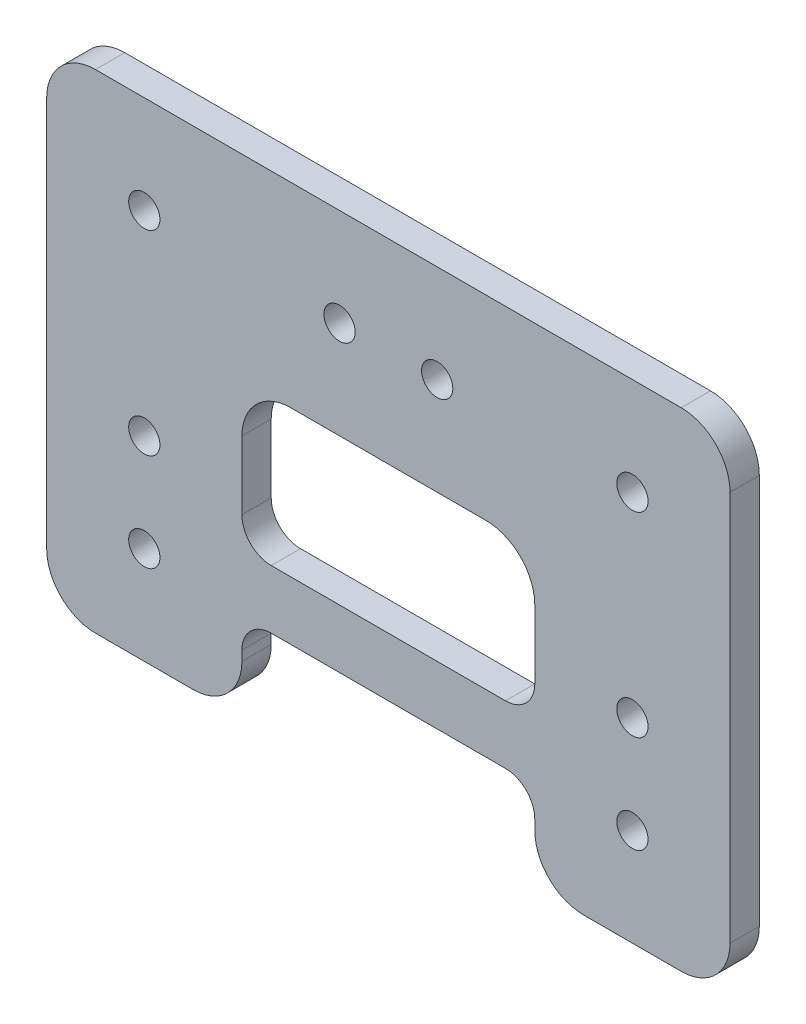
ISO-10303-21;
HEADER;
FILE_DESCRIPTION(('STEP AP214'),'2;1');
FILE_NAME('part.step','',(''),(''),'','','');
FILE_SCHEMA(('AUTOMOTIVE_DESIGN { 1 0 10303 214 1 1 1 1 }'));
ENDSEC;
DATA;
#1=APPLICATION_CONTEXT('core data for automotive mechanical design processes');
#2=APPLICATION_PROTOCOL_DEFINITION('international standard','automotive_design',2000,#1);
#3=PRODUCT_CONTEXT('',#1,'mechanical');
#4=PRODUCT('Part','Part','',(#3));
#5=PRODUCT_RELATED_PRODUCT_CATEGORY('part','',(#4));
#6=PRODUCT_DEFINITION_FORMATION('','',#4);
#7=PRODUCT_DEFINITION_CONTEXT('part definition',#1,'design');
#8=PRODUCT_DEFINITION('design','',#6,#7);
#9=PRODUCT_DEFINITION_SHAPE('','',#8);
#10=(LENGTH_UNIT() NAMED_UNIT(*) SI_UNIT(.MILLI.,.METRE.));
#11=(NAMED_UNIT(*) PLANE_ANGLE_UNIT() SI_UNIT($,.RADIAN.));
#12=(NAMED_UNIT(*) SI_UNIT($,.STERADIAN.) SOLID_ANGLE_UNIT());
#13=UNCERTAINTY_MEASURE_WITH_UNIT(LENGTH_MEASURE(1.E-05),#10,'distance_accuracy_value','');
#14=(GEOMETRIC_REPRESENTATION_CONTEXT(3) GLOBAL_UNCERTAINTY_ASSIGNED_CONTEXT((#13)) GLOBAL_UNIT_ASSIGNED_CONTEXT((#10,
#11,#12)) REPRESENTATION_CONTEXT('',''));
#15=CARTESIAN_POINT('',(0.,0.,0.));
#16=DIRECTION('',(0.,0.,1.));
#17=DIRECTION('',(1.,0.,0.));
#18=AXIS2_PLACEMENT_3D('',#15,#16,#17);
#19=CARTESIAN_POINT('',(-15.,-25.,0.));
#20=DIRECTION('',(-1.,0.,0.));
#21=DIRECTION('',(0.,-1.,0.));
#22=AXIS2_PLACEMENT_3D('',#19,#20,#21);
#23=PLANE('',#22);
#24=DIRECTION('',(0.,-1.,0.));
#25=VECTOR('',#24,1.);
#26=CARTESIAN_POINT('',(-15.,-25.,3.));
#27=LINE('',#26,#25);
#28=CARTESIAN_POINT('',(-15.,0.,3.));
#29=VERTEX_POINT('',#28);
#30=CARTESIAN_POINT('',(-15.,-7.00000000000001,3.));
#31=VERTEX_POINT('',#30);
#32=EDGE_CURVE('E377',#29,#31,#27,.T.);
#33=ORIENTED_EDGE('',*,*,#32,.T.);
#34=DIRECTION('',(0.,0.,1.));
#35=VECTOR('',#34,1.);
#36=CARTESIAN_POINT('',(-15.,-7.00000000000001,0.));
#37=LINE('',#36,#35);
#38=CARTESIAN_POINT('',(-15.,-7.00000000000001,0.));
#39=VERTEX_POINT('',#38);
#40=EDGE_CURVE('E49',#31,#39,#37,.F.);
#41=ORIENTED_EDGE('',*,*,#40,.T.);
#42=DIRECTION('',(0.,-1.,0.));
#43=VECTOR('',#42,1.);
#44=CARTESIAN_POINT('',(-15.,-25.,0.));
#45=LINE('',#44,#43);
#46=CARTESIAN_POINT('',(-15.,0.,0.));
#47=VERTEX_POINT('',#46);
#48=EDGE_CURVE('E343',#47,#39,#45,.T.);
#49=ORIENTED_EDGE('',*,*,#48,.F.);
#50=DIRECTION('',(0.,0.,1.));
#51=VECTOR('',#50,1.);
#52=CARTESIAN_POINT('',(-15.,0.,3.));
#53=LINE('',#52,#51);
#54=EDGE_CURVE('E280',#47,#29,#53,.T.);
#55=ORIENTED_EDGE('',*,*,#54,.T.);
#56=EDGE_LOOP('',(#33,#41,#49,#55));
#57=FACE_BOUND('',#56,.T.);
#58=ADVANCED_FACE('F34',(#57),#23,.F.);
#59=CARTESIAN_POINT('',(15.,5.,0.));
#60=DIRECTION('',(1.,0.,0.));
#61=DIRECTION('',(0.,1.,0.));
#62=AXIS2_PLACEMENT_3D('',#59,#60,#61);
#63=PLANE('',#62);
#64=DIRECTION('',(0.,1.,0.));
#65=VECTOR('',#64,1.);
#66=CARTESIAN_POINT('',(15.,5.,0.));
#67=LINE('',#66,#65);
#68=CARTESIAN_POINT('',(15.,-7.,0.));
#69=VERTEX_POINT('',#68);
#70=CARTESIAN_POINT('',(15.,0.,0.));
#71=VERTEX_POINT('',#70);
#72=EDGE_CURVE('E366',#69,#71,#67,.T.);
#73=ORIENTED_EDGE('',*,*,#72,.F.);
#74=DIRECTION('',(0.,0.,1.));
#75=VECTOR('',#74,1.);
#76=CARTESIAN_POINT('',(15.,-7.,0.));
#77=LINE('',#76,#75);
#78=CARTESIAN_POINT('',(15.,-7.,3.));
#79=VERTEX_POINT('',#78);
#80=EDGE_CURVE('E300',#69,#79,#77,.T.);
#81=ORIENTED_EDGE('',*,*,#80,.T.);
#82=DIRECTION('',(0.,1.,0.));
#83=VECTOR('',#82,1.);
#84=CARTESIAN_POINT('',(15.,5.,3.));
#85=LINE('',#84,#83);
#86=CARTESIAN_POINT('',(15.,0.,3.));
#87=VERTEX_POINT('',#86);
#88=EDGE_CURVE('E374',#79,#87,#85,.T.);
#89=ORIENTED_EDGE('',*,*,#88,.T.);
#90=DIRECTION('',(0.,0.,1.));
#91=VECTOR('',#90,1.);
#92=CARTESIAN_POINT('',(15.,0.,0.));
#93=LINE('',#92,#91);
#94=EDGE_CURVE('E268',#87,#71,#93,.F.);
#95=ORIENTED_EDGE('',*,*,#94,.T.);
#96=EDGE_LOOP('',(#73,#81,#89,#95));
#97=FACE_BOUND('',#96,.T.);
#98=ADVANCED_FACE('F459',(#97),#63,.F.);
#99=CARTESIAN_POINT('',(-35.,-25.,3.));
#100=DIRECTION('',(0.,1.,0.));
#101=DIRECTION('',(0.,0.,1.));
#102=AXIS2_PLACEMENT_3D('',#99,#100,#101);
#103=PLANE('',#102);
#104=DIRECTION('',(1.,0.,0.));
#105=VECTOR('',#104,1.);
#106=CARTESIAN_POINT('',(-35.,-25.,3.));
#107=LINE('',#106,#105);
#108=CARTESIAN_POINT('',(-30.,-25.,3.));
#109=VERTEX_POINT('',#108);
#110=CARTESIAN_POINT('',(-20.,-25.,3.));
#111=VERTEX_POINT('',#110);
#112=EDGE_CURVE('E234',#109,#111,#107,.T.);
#113=ORIENTED_EDGE('',*,*,#112,.F.);
#114=DIRECTION('',(0.,0.,-1.));
#115=VECTOR('',#114,1.);
#116=CARTESIAN_POINT('',(-30.,-25.,3.));
#117=LINE('',#116,#115);
#118=CARTESIAN_POINT('',(-30.,-25.,0.));
#119=VERTEX_POINT('',#118);
#120=EDGE_CURVE('E277',#109,#119,#117,.T.);
#121=ORIENTED_EDGE('',*,*,#120,.T.);
#122=DIRECTION('',(1.,0.,0.));
#123=VECTOR('',#122,1.);
#124=CARTESIAN_POINT('',(-35.,-25.,0.));
#125=LINE('',#124,#123);
#126=CARTESIAN_POINT('',(-20.,-25.,0.));
#127=VERTEX_POINT('',#126);
#128=EDGE_CURVE('E228',#119,#127,#125,.T.);
#129=ORIENTED_EDGE('',*,*,#128,.T.);
#130=DIRECTION('',(0.,0.,1.));
#131=VECTOR('',#130,1.);
#132=CARTESIAN_POINT('',(-20.,-25.,3.));
#133=LINE('',#132,#131);
#134=EDGE_CURVE('E274',#127,#111,#133,.T.);
#135=ORIENTED_EDGE('',*,*,#134,.T.);
#136=EDGE_LOOP('',(#113,#121,#129,#135));
#137=FACE_BOUND('',#136,.T.);
#138=ADVANCED_FACE('F464',(#137),#103,.F.);
#139=CARTESIAN_POINT('',(0.,0.,3.));
#140=DIRECTION('',(0.,0.,1.));
#141=DIRECTION('',(1.,0.,0.));
#142=AXIS2_PLACEMENT_3D('',#139,#140,#141);
#143=PLANE('',#142);
#144=CARTESIAN_POINT('',(-15.,-19.,3.));
#145=VERTEX_POINT('',#144);
#146=CARTESIAN_POINT('',(-15.,-20.,3.));
#147=VERTEX_POINT('',#146);
#148=EDGE_CURVE('E352',#145,#147,#27,.T.);
#149=ORIENTED_EDGE('',*,*,#148,.F.);
#150=CARTESIAN_POINT('',(-12.,-19.,3.));
#151=DIRECTION('',(0.,0.,1.));
#152=DIRECTION('',(1.,0.,0.));
#153=AXIS2_PLACEMENT_3D('',#150,#151,#152);
#154=CIRCLE('',#153,3.);
#155=CARTESIAN_POINT('',(-12.,-16.,3.));
#156=VERTEX_POINT('',#155);
#157=EDGE_CURVE('E327',#145,#156,#154,.F.);
#158=ORIENTED_EDGE('',*,*,#157,.T.);
#159=DIRECTION('',(1.,0.,0.));
#160=VECTOR('',#159,1.);
#161=CARTESIAN_POINT('',(-15.,-16.,3.));
#162=LINE('',#161,#160);
#163=CARTESIAN_POINT('',(12.,-16.,3.));
#164=VERTEX_POINT('',#163);
#165=EDGE_CURVE('E351',#156,#164,#162,.T.);
#166=ORIENTED_EDGE('',*,*,#165,.T.);
#167=CARTESIAN_POINT('',(12.,-19.,3.));
#168=DIRECTION('',(0.,0.,1.));
#169=DIRECTION('',(1.,0.,0.));
#170=AXIS2_PLACEMENT_3D('',#167,#168,#169);
#171=CIRCLE('',#170,3.);
#172=CARTESIAN_POINT('',(15.,-19.,3.));
#173=VERTEX_POINT('',#172);
#174=EDGE_CURVE('E323',#164,#173,#171,.F.);
#175=ORIENTED_EDGE('',*,*,#174,.T.);
#176=CARTESIAN_POINT('',(15.,-20.,3.));
#177=VERTEX_POINT('',#176);
#178=EDGE_CURVE('E370',#177,#173,#85,.T.);
#179=ORIENTED_EDGE('',*,*,#178,.F.);
#180=CARTESIAN_POINT('',(20.,-20.,3.));
#181=DIRECTION('',(0.,0.,1.));
#182=DIRECTION('',(1.,0.,0.));
#183=AXIS2_PLACEMENT_3D('',#180,#181,#182);
#184=CIRCLE('',#183,5.);
#185=CARTESIAN_POINT('',(20.,-25.,3.));
#186=VERTEX_POINT('',#185);
#187=EDGE_CURVE('E251',#177,#186,#184,.T.);
#188=ORIENTED_EDGE('',*,*,#187,.T.);
#189=CARTESIAN_POINT('',(30.,-25.,3.));
#190=VERTEX_POINT('',#189);
#191=EDGE_CURVE('E433',#186,#190,#107,.T.);
#192=ORIENTED_EDGE('',*,*,#191,.T.);
#193=CARTESIAN_POINT('',(30.,-20.,3.));
#194=DIRECTION('',(0.,0.,1.));
#195=DIRECTION('',(1.,0.,0.));
#196=AXIS2_PLACEMENT_3D('',#193,#194,#195);
#197=CIRCLE('',#196,5.);
#198=CARTESIAN_POINT('',(35.,-20.,3.));
#199=VERTEX_POINT('',#198);
#200=EDGE_CURVE('E253',#190,#199,#197,.T.);
#201=ORIENTED_EDGE('',*,*,#200,.T.);
#202=DIRECTION('',(0.,1.,0.));
#203=VECTOR('',#202,1.);
#204=CARTESIAN_POINT('',(35.,25.,3.));
#205=LINE('',#204,#203);
#206=CARTESIAN_POINT('',(35.,20.,3.));
#207=VERTEX_POINT('',#206);
#208=EDGE_CURVE('E426',#199,#207,#205,.T.);
#209=ORIENTED_EDGE('',*,*,#208,.T.);
#210=CARTESIAN_POINT('',(30.,20.,3.));
#211=DIRECTION('',(0.,0.,1.));
#212=DIRECTION('',(1.,0.,0.));
#213=AXIS2_PLACEMENT_3D('',#210,#211,#212);
#214=CIRCLE('',#213,5.);
#215=CARTESIAN_POINT('',(30.,25.,3.));
#216=VERTEX_POINT('',#215);
#217=EDGE_CURVE('E255',#207,#216,#214,.T.);
#218=ORIENTED_EDGE('',*,*,#217,.T.);
#219=DIRECTION('',(-1.,0.,0.));
#220=VECTOR('',#219,1.);
#221=CARTESIAN_POINT('',(-35.,25.,3.));
#222=LINE('',#221,#220);
#223=CARTESIAN_POINT('',(-30.,25.,3.));
#224=VERTEX_POINT('',#223);
#225=EDGE_CURVE('E429',#216,#224,#222,.T.);
#226=ORIENTED_EDGE('',*,*,#225,.T.);
#227=CARTESIAN_POINT('',(-30.,20.,3.));
#228=DIRECTION('',(0.,0.,1.));
#229=DIRECTION('',(1.,0.,0.));
#230=AXIS2_PLACEMENT_3D('',#227,#228,#229);
#231=CIRCLE('',#230,5.);
#232=CARTESIAN_POINT('',(-35.,20.,3.));
#233=VERTEX_POINT('',#232);
#234=EDGE_CURVE('E257',#224,#233,#231,.T.);
#235=ORIENTED_EDGE('',*,*,#234,.T.);
#236=DIRECTION('',(0.,-1.,0.));
#237=VECTOR('',#236,1.);
#238=CARTESIAN_POINT('',(-35.,25.,3.));
#239=LINE('',#238,#237);
#240=CARTESIAN_POINT('',(-35.,-20.,3.));
#241=VERTEX_POINT('',#240);
#242=EDGE_CURVE('E215',#233,#241,#239,.T.);
#243=ORIENTED_EDGE('',*,*,#242,.T.);
#244=CARTESIAN_POINT('',(-30.,-20.,3.));
#245=DIRECTION('',(0.,0.,1.));
#246=DIRECTION('',(1.,0.,0.));
#247=AXIS2_PLACEMENT_3D('',#244,#245,#246);
#248=CIRCLE('',#247,5.);
#249=EDGE_CURVE('E249',#241,#109,#248,.T.);
#250=ORIENTED_EDGE('',*,*,#249,.T.);
#251=ORIENTED_EDGE('',*,*,#112,.T.);
#252=CARTESIAN_POINT('',(-20.,-20.,3.));
#253=DIRECTION('',(0.,0.,1.));
#254=DIRECTION('',(1.,0.,0.));
#255=AXIS2_PLACEMENT_3D('',#252,#253,#254);
#256=CIRCLE('',#255,5.);
#257=EDGE_CURVE('E246',#111,#147,#256,.T.);
#258=ORIENTED_EDGE('',*,*,#257,.T.);
#259=EDGE_LOOP('',(#149,#158,#166,#175,#179,#188,#192,#201,#209,#218,#226,#235,#243,#250,#251,#258));
#260=FACE_BOUND('',#259,.T.);
#261=ORIENTED_EDGE('',*,*,#88,.F.);
#262=CARTESIAN_POINT('',(12.,-7.,3.));
#263=DIRECTION('',(0.,0.,1.));
#264=DIRECTION('',(1.,0.,0.));
#265=AXIS2_PLACEMENT_3D('',#262,#263,#264);
#266=CIRCLE('',#265,3.);
#267=CARTESIAN_POINT('',(12.,-10.,3.));
#268=VERTEX_POINT('',#267);
#269=EDGE_CURVE('E319',#79,#268,#266,.F.);
#270=ORIENTED_EDGE('',*,*,#269,.T.);
#271=DIRECTION('',(-1.,0.,0.));
#272=VECTOR('',#271,1.);
#273=CARTESIAN_POINT('',(15.,-10.,3.));
#274=LINE('',#273,#272);
#275=CARTESIAN_POINT('',(-12.,-10.,3.));
#276=VERTEX_POINT('',#275);
#277=EDGE_CURVE('E356',#268,#276,#274,.T.);
#278=ORIENTED_EDGE('',*,*,#277,.T.);
#279=CARTESIAN_POINT('',(-12.,-7.00000000000001,3.));
#280=DIRECTION('',(0.,0.,1.));
#281=DIRECTION('',(1.,0.,0.));
#282=AXIS2_PLACEMENT_3D('',#279,#280,#281);
#283=CIRCLE('',#282,3.);
#284=EDGE_CURVE('E42',#276,#31,#283,.F.);
#285=ORIENTED_EDGE('',*,*,#284,.T.);
#286=ORIENTED_EDGE('',*,*,#32,.F.);
#287=CARTESIAN_POINT('',(-9.99999999999999,0.,3.));
#288=DIRECTION('',(0.,0.,1.));
#289=DIRECTION('',(1.,0.,0.));
#290=AXIS2_PLACEMENT_3D('',#287,#288,#289);
#291=CIRCLE('',#290,5.);
#292=CARTESIAN_POINT('',(-9.99999999999999,5.,3.));
#293=VERTEX_POINT('',#292);
#294=EDGE_CURVE('E296',#29,#293,#291,.F.);
#295=ORIENTED_EDGE('',*,*,#294,.T.);
#296=DIRECTION('',(-1.,0.,0.));
#297=VECTOR('',#296,1.);
#298=CARTESIAN_POINT('',(-15.,5.,3.));
#299=LINE('',#298,#297);
#300=CARTESIAN_POINT('',(9.99999999999999,5.,3.));
#301=VERTEX_POINT('',#300);
#302=EDGE_CURVE('E373',#301,#293,#299,.T.);
#303=ORIENTED_EDGE('',*,*,#302,.F.);
#304=CARTESIAN_POINT('',(10.,0.,3.));
#305=DIRECTION('',(0.,0.,1.));
#306=DIRECTION('',(1.,0.,0.));
#307=AXIS2_PLACEMENT_3D('',#304,#305,#306);
#308=CIRCLE('',#307,5.);
#309=EDGE_CURVE('E291',#301,#87,#308,.F.);
#310=ORIENTED_EDGE('',*,*,#309,.T.);
#311=EDGE_LOOP('',(#261,#270,#278,#285,#286,#295,#303,#310));
#312=FACE_BOUND('',#311,.T.);
#313=CARTESIAN_POINT('',(25.,-4.99999999999999,3.));
#314=DIRECTION('',(0.,0.,1.));
#315=DIRECTION('',(-1.,0.,0.));
#316=AXIS2_PLACEMENT_3D('',#313,#314,#315);
#317=CIRCLE('',#316,1.60000000000001);
#318=CARTESIAN_POINT('',(23.4,-4.99999999999999,3.));
#319=VERTEX_POINT('',#318);
#320=EDGE_CURVE('E385',#319,#319,#317,.T.);
#321=ORIENTED_EDGE('',*,*,#320,.F.);
#322=EDGE_LOOP('',(#321));
#323=FACE_BOUND('',#322,.T.);
#324=CARTESIAN_POINT('',(5.,15.,3.));
#325=DIRECTION('',(0.,0.,1.));
#326=DIRECTION('',(-1.,0.,0.));
#327=AXIS2_PLACEMENT_3D('',#324,#325,#326);
#328=CIRCLE('',#327,1.6);
#329=CARTESIAN_POINT('',(3.4,15.,3.));
#330=VERTEX_POINT('',#329);
#331=EDGE_CURVE('E397',#330,#330,#328,.T.);
#332=ORIENTED_EDGE('',*,*,#331,.F.);
#333=EDGE_LOOP('',(#332));
#334=FACE_BOUND('',#333,.T.);
#335=CARTESIAN_POINT('',(-25.,15.,3.));
#336=DIRECTION('',(0.,0.,1.));
#337=DIRECTION('',(1.,0.,0.));
#338=AXIS2_PLACEMENT_3D('',#335,#336,#337);
#339=CIRCLE('',#338,1.6);
#340=CARTESIAN_POINT('',(-23.4,15.,3.));
#341=VERTEX_POINT('',#340);
#342=EDGE_CURVE('E409',#341,#341,#339,.T.);
#343=ORIENTED_EDGE('',*,*,#342,.F.);
#344=EDGE_LOOP('',(#343));
#345=FACE_BOUND('',#344,.T.);
#346=CARTESIAN_POINT('',(-25.,-15.,3.));
#347=DIRECTION('',(0.,0.,1.));
#348=DIRECTION('',(1.,0.,0.));
#349=AXIS2_PLACEMENT_3D('',#346,#347,#348);
#350=CIRCLE('',#349,1.6);
#351=CARTESIAN_POINT('',(-23.4,-15.,3.));
#352=VERTEX_POINT('',#351);
#353=EDGE_CURVE('E421',#352,#352,#350,.T.);
#354=ORIENTED_EDGE('',*,*,#353,.F.);
#355=EDGE_LOOP('',(#354));
#356=FACE_BOUND('',#355,.T.);
#357=CARTESIAN_POINT('',(-25.,-4.99999999999999,3.));
#358=DIRECTION('',(0.,0.,1.));
#359=DIRECTION('',(1.,0.,0.));
#360=AXIS2_PLACEMENT_3D('',#357,#358,#359);
#361=CIRCLE('',#360,1.6);
#362=CARTESIAN_POINT('',(-23.4,-4.99999999999999,3.));
#363=VERTEX_POINT('',#362);
#364=EDGE_CURVE('E415',#363,#363,#361,.T.);
#365=ORIENTED_EDGE('',*,*,#364,.F.);
#366=EDGE_LOOP('',(#365));
#367=FACE_BOUND('',#366,.T.);
#368=CARTESIAN_POINT('',(-5.,15.,3.));
#369=DIRECTION('',(0.,0.,1.));
#370=DIRECTION('',(1.,0.,0.));
#371=AXIS2_PLACEMENT_3D('',#368,#369,#370);
#372=CIRCLE('',#371,1.6);
#373=CARTESIAN_POINT('',(-3.4,15.,3.));
#374=VERTEX_POINT('',#373);
#375=EDGE_CURVE('E403',#374,#374,#372,.T.);
#376=ORIENTED_EDGE('',*,*,#375,.F.);
#377=EDGE_LOOP('',(#376));
#378=FACE_BOUND('',#377,.T.);
#379=CARTESIAN_POINT('',(25.,15.,3.));
#380=DIRECTION('',(0.,0.,1.));
#381=DIRECTION('',(-1.,0.,0.));
#382=AXIS2_PLACEMENT_3D('',#379,#380,#381);
#383=CIRCLE('',#382,1.60000000000001);
#384=CARTESIAN_POINT('',(23.4,15.,3.));
#385=VERTEX_POINT('',#384);
#386=EDGE_CURVE('E391',#385,#385,#383,.T.);
#387=ORIENTED_EDGE('',*,*,#386,.F.);
#388=EDGE_LOOP('',(#387));
#389=FACE_BOUND('',#388,.T.);
#390=CARTESIAN_POINT('',(25.,-15.,3.));
#391=DIRECTION('',(0.,0.,1.));
#392=DIRECTION('',(-1.,0.,0.));
#393=AXIS2_PLACEMENT_3D('',#390,#391,#392);
#394=CIRCLE('',#393,1.6);
#395=CARTESIAN_POINT('',(23.4,-15.,3.));
#396=VERTEX_POINT('',#395);
#397=EDGE_CURVE('E379',#396,#396,#394,.T.);
#398=ORIENTED_EDGE('',*,*,#397,.F.);
#399=EDGE_LOOP('',(#398));
#400=FACE_BOUND('',#399,.T.);
#401=ADVANCED_FACE('F350',(#260,#312,#323,#334,#345,#356,#367,#378,#389,#400),#143,.T.);
#402=CARTESIAN_POINT('',(0.,0.,0.));
#403=DIRECTION('',(0.,0.,1.));
#404=DIRECTION('',(1.,0.,0.));
#405=AXIS2_PLACEMENT_3D('',#402,#403,#404);
#406=PLANE('',#405);
#407=DIRECTION('',(1.,0.,0.));
#408=VECTOR('',#407,1.);
#409=CARTESIAN_POINT('',(-15.,-16.,0.));
#410=LINE('',#409,#408);
#411=CARTESIAN_POINT('',(-12.,-16.,0.));
#412=VERTEX_POINT('',#411);
#413=CARTESIAN_POINT('',(12.,-16.,0.));
#414=VERTEX_POINT('',#413);
#415=EDGE_CURVE('E334',#412,#414,#410,.T.);
#416=ORIENTED_EDGE('',*,*,#415,.F.);
#417=CARTESIAN_POINT('',(-12.,-19.,0.));
#418=DIRECTION('',(0.,0.,1.));
#419=DIRECTION('',(1.,0.,0.));
#420=AXIS2_PLACEMENT_3D('',#417,#418,#419);
#421=CIRCLE('',#420,3.);
#422=CARTESIAN_POINT('',(-15.,-19.,0.));
#423=VERTEX_POINT('',#422);
#424=EDGE_CURVE('E329',#412,#423,#421,.T.);
#425=ORIENTED_EDGE('',*,*,#424,.T.);
#426=CARTESIAN_POINT('',(-15.,-20.,0.));
#427=VERTEX_POINT('',#426);
#428=EDGE_CURVE('E332',#423,#427,#45,.T.);
#429=ORIENTED_EDGE('',*,*,#428,.T.);
#430=CARTESIAN_POINT('',(-20.,-20.,0.));
#431=DIRECTION('',(0.,0.,1.));
#432=DIRECTION('',(1.,0.,0.));
#433=AXIS2_PLACEMENT_3D('',#430,#431,#432);
#434=CIRCLE('',#433,5.);
#435=EDGE_CURVE('E216',#427,#127,#434,.F.);
#436=ORIENTED_EDGE('',*,*,#435,.T.);
#437=ORIENTED_EDGE('',*,*,#128,.F.);
#438=CARTESIAN_POINT('',(-30.,-20.,0.));
#439=DIRECTION('',(0.,0.,1.));
#440=DIRECTION('',(1.,0.,0.));
#441=AXIS2_PLACEMENT_3D('',#438,#439,#440);
#442=CIRCLE('',#441,5.);
#443=CARTESIAN_POINT('',(-35.,-20.,0.));
#444=VERTEX_POINT('',#443);
#445=EDGE_CURVE('E223',#119,#444,#442,.F.);
#446=ORIENTED_EDGE('',*,*,#445,.T.);
#447=DIRECTION('',(0.,-1.,0.));
#448=VECTOR('',#447,1.);
#449=CARTESIAN_POINT('',(-35.,25.,0.));
#450=LINE('',#449,#448);
#451=CARTESIAN_POINT('',(-35.,20.,0.));
#452=VERTEX_POINT('',#451);
#453=EDGE_CURVE('E212',#452,#444,#450,.T.);
#454=ORIENTED_EDGE('',*,*,#453,.F.);
#455=CARTESIAN_POINT('',(-30.,20.,0.));
#456=DIRECTION('',(0.,0.,1.));
#457=DIRECTION('',(1.,0.,0.));
#458=AXIS2_PLACEMENT_3D('',#455,#456,#457);
#459=CIRCLE('',#458,5.);
#460=CARTESIAN_POINT('',(-30.,25.,0.));
#461=VERTEX_POINT('',#460);
#462=EDGE_CURVE('E195',#452,#461,#459,.F.);
#463=ORIENTED_EDGE('',*,*,#462,.T.);
#464=DIRECTION('',(-1.,0.,0.));
#465=VECTOR('',#464,1.);
#466=CARTESIAN_POINT('',(-35.,25.,0.));
#467=LINE('',#466,#465);
#468=CARTESIAN_POINT('',(30.,25.,0.));
#469=VERTEX_POINT('',#468);
#470=EDGE_CURVE('E225',#469,#461,#467,.T.);
#471=ORIENTED_EDGE('',*,*,#470,.F.);
#472=CARTESIAN_POINT('',(30.,20.,0.));
#473=DIRECTION('',(0.,0.,1.));
#474=DIRECTION('',(1.,0.,0.));
#475=AXIS2_PLACEMENT_3D('',#472,#473,#474);
#476=CIRCLE('',#475,5.);
#477=CARTESIAN_POINT('',(35.,20.,0.));
#478=VERTEX_POINT('',#477);
#479=EDGE_CURVE('E206',#469,#478,#476,.F.);
#480=ORIENTED_EDGE('',*,*,#479,.T.);
#481=DIRECTION('',(0.,1.,0.));
#482=VECTOR('',#481,1.);
#483=CARTESIAN_POINT('',(35.,25.,0.));
#484=LINE('',#483,#482);
#485=CARTESIAN_POINT('',(35.,-20.,0.));
#486=VERTEX_POINT('',#485);
#487=EDGE_CURVE('E230',#486,#478,#484,.T.);
#488=ORIENTED_EDGE('',*,*,#487,.F.);
#489=CARTESIAN_POINT('',(30.,-20.,0.));
#490=DIRECTION('',(0.,0.,1.));
#491=DIRECTION('',(1.,0.,0.));
#492=AXIS2_PLACEMENT_3D('',#489,#490,#491);
#493=CIRCLE('',#492,5.);
#494=CARTESIAN_POINT('',(30.,-25.,0.));
#495=VERTEX_POINT('',#494);
#496=EDGE_CURVE('E240',#486,#495,#493,.F.);
#497=ORIENTED_EDGE('',*,*,#496,.T.);
#498=CARTESIAN_POINT('',(20.,-25.,0.));
#499=VERTEX_POINT('',#498);
#500=EDGE_CURVE('E224',#499,#495,#125,.T.);
#501=ORIENTED_EDGE('',*,*,#500,.F.);
#502=CARTESIAN_POINT('',(20.,-20.,0.));
#503=DIRECTION('',(0.,0.,1.));
#504=DIRECTION('',(1.,0.,0.));
#505=AXIS2_PLACEMENT_3D('',#502,#503,#504);
#506=CIRCLE('',#505,5.);
#507=CARTESIAN_POINT('',(15.,-20.,0.));
#508=VERTEX_POINT('',#507);
#509=EDGE_CURVE('E238',#499,#508,#506,.F.);
#510=ORIENTED_EDGE('',*,*,#509,.T.);
#511=CARTESIAN_POINT('',(15.,-19.,0.));
#512=VERTEX_POINT('',#511);
#513=EDGE_CURVE('E363',#508,#512,#67,.T.);
#514=ORIENTED_EDGE('',*,*,#513,.T.);
#515=CARTESIAN_POINT('',(12.,-19.,0.));
#516=DIRECTION('',(0.,0.,1.));
#517=DIRECTION('',(1.,0.,0.));
#518=AXIS2_PLACEMENT_3D('',#515,#516,#517);
#519=CIRCLE('',#518,3.);
#520=EDGE_CURVE('E325',#512,#414,#519,.T.);
#521=ORIENTED_EDGE('',*,*,#520,.T.);
#522=EDGE_LOOP('',(#416,#425,#429,#436,#437,#446,#454,#463,#471,#480,#488,#497,#501,#510,#514,#521));
#523=FACE_BOUND('',#522,.T.);
#524=ORIENTED_EDGE('',*,*,#48,.T.);
#525=CARTESIAN_POINT('',(-12.,-7.00000000000001,0.));
#526=DIRECTION('',(0.,0.,1.));
#527=DIRECTION('',(1.,0.,0.));
#528=AXIS2_PLACEMENT_3D('',#525,#526,#527);
#529=CIRCLE('',#528,3.);
#530=CARTESIAN_POINT('',(-12.,-10.,0.));
#531=VERTEX_POINT('',#530);
#532=EDGE_CURVE('E11',#39,#531,#529,.T.);
#533=ORIENTED_EDGE('',*,*,#532,.T.);
#534=DIRECTION('',(-1.,0.,0.));
#535=VECTOR('',#534,1.);
#536=CARTESIAN_POINT('',(15.,-10.,0.));
#537=LINE('',#536,#535);
#538=CARTESIAN_POINT('',(12.,-10.,0.));
#539=VERTEX_POINT('',#538);
#540=EDGE_CURVE('E360',#539,#531,#537,.T.);
#541=ORIENTED_EDGE('',*,*,#540,.F.);
#542=CARTESIAN_POINT('',(12.,-7.,0.));
#543=DIRECTION('',(0.,0.,1.));
#544=DIRECTION('',(1.,0.,0.));
#545=AXIS2_PLACEMENT_3D('',#542,#543,#544);
#546=CIRCLE('',#545,3.);
#547=EDGE_CURVE('E321',#539,#69,#546,.T.);
#548=ORIENTED_EDGE('',*,*,#547,.T.);
#549=ORIENTED_EDGE('',*,*,#72,.T.);
#550=CARTESIAN_POINT('',(10.,0.,0.));
#551=DIRECTION('',(0.,0.,1.));
#552=DIRECTION('',(1.,0.,0.));
#553=AXIS2_PLACEMENT_3D('',#550,#551,#552);
#554=CIRCLE('',#553,5.);
#555=CARTESIAN_POINT('',(9.99999999999999,5.,0.));
#556=VERTEX_POINT('',#555);
#557=EDGE_CURVE('E294',#71,#556,#554,.T.);
#558=ORIENTED_EDGE('',*,*,#557,.T.);
#559=DIRECTION('',(-1.,0.,0.));
#560=VECTOR('',#559,1.);
#561=CARTESIAN_POINT('',(-15.,5.,0.));
#562=LINE('',#561,#560);
#563=CARTESIAN_POINT('',(-9.99999999999999,5.,0.));
#564=VERTEX_POINT('',#563);
#565=EDGE_CURVE('E344',#556,#564,#562,.T.);
#566=ORIENTED_EDGE('',*,*,#565,.T.);
#567=CARTESIAN_POINT('',(-9.99999999999999,0.,0.));
#568=DIRECTION('',(0.,0.,1.));
#569=DIRECTION('',(1.,0.,0.));
#570=AXIS2_PLACEMENT_3D('',#567,#568,#569);
#571=CIRCLE('',#570,5.);
#572=EDGE_CURVE('E298',#564,#47,#571,.T.);
#573=ORIENTED_EDGE('',*,*,#572,.T.);
#574=EDGE_LOOP('',(#524,#533,#541,#548,#549,#558,#566,#573));
#575=FACE_BOUND('',#574,.T.);
#576=CARTESIAN_POINT('',(-25.,-15.,0.));
#577=DIRECTION('',(0.,0.,1.));
#578=DIRECTION('',(1.,0.,0.));
#579=AXIS2_PLACEMENT_3D('',#576,#577,#578);
#580=CIRCLE('',#579,1.6);
#581=CARTESIAN_POINT('',(-23.4,-15.,0.));
#582=VERTEX_POINT('',#581);
#583=EDGE_CURVE('E418',#582,#582,#580,.T.);
#584=ORIENTED_EDGE('',*,*,#583,.T.);
#585=EDGE_LOOP('',(#584));
#586=FACE_BOUND('',#585,.T.);
#587=CARTESIAN_POINT('',(-25.,-4.99999999999999,0.));
#588=DIRECTION('',(0.,0.,1.));
#589=DIRECTION('',(1.,0.,0.));
#590=AXIS2_PLACEMENT_3D('',#587,#588,#589);
#591=CIRCLE('',#590,1.6);
#592=CARTESIAN_POINT('',(-23.4,-4.99999999999999,0.));
#593=VERTEX_POINT('',#592);
#594=EDGE_CURVE('E412',#593,#593,#591,.T.);
#595=ORIENTED_EDGE('',*,*,#594,.T.);
#596=EDGE_LOOP('',(#595));
#597=FACE_BOUND('',#596,.T.);
#598=CARTESIAN_POINT('',(-25.,15.,0.));
#599=DIRECTION('',(0.,0.,1.));
#600=DIRECTION('',(1.,0.,0.));
#601=AXIS2_PLACEMENT_3D('',#598,#599,#600);
#602=CIRCLE('',#601,1.6);
#603=CARTESIAN_POINT('',(-23.4,15.,0.));
#604=VERTEX_POINT('',#603);
#605=EDGE_CURVE('E406',#604,#604,#602,.T.);
#606=ORIENTED_EDGE('',*,*,#605,.T.);
#607=EDGE_LOOP('',(#606));
#608=FACE_BOUND('',#607,.T.);
#609=CARTESIAN_POINT('',(-5.,15.,0.));
#610=DIRECTION('',(0.,0.,1.));
#611=DIRECTION('',(1.,0.,0.));
#612=AXIS2_PLACEMENT_3D('',#609,#610,#611);
#613=CIRCLE('',#612,1.6);
#614=CARTESIAN_POINT('',(-3.4,15.,0.));
#615=VERTEX_POINT('',#614);
#616=EDGE_CURVE('E400',#615,#615,#613,.T.);
#617=ORIENTED_EDGE('',*,*,#616,.T.);
#618=EDGE_LOOP('',(#617));
#619=FACE_BOUND('',#618,.T.);
#620=CARTESIAN_POINT('',(5.,15.,0.));
#621=DIRECTION('',(0.,0.,1.));
#622=DIRECTION('',(-1.,0.,0.));
#623=AXIS2_PLACEMENT_3D('',#620,#621,#622);
#624=CIRCLE('',#623,1.6);
#625=CARTESIAN_POINT('',(3.4,15.,0.));
#626=VERTEX_POINT('',#625);
#627=EDGE_CURVE('E394',#626,#626,#624,.T.);
#628=ORIENTED_EDGE('',*,*,#627,.T.);
#629=EDGE_LOOP('',(#628));
#630=FACE_BOUND('',#629,.T.);
#631=CARTESIAN_POINT('',(25.,15.,0.));
#632=DIRECTION('',(0.,0.,1.));
#633=DIRECTION('',(-1.,0.,0.));
#634=AXIS2_PLACEMENT_3D('',#631,#632,#633);
#635=CIRCLE('',#634,1.60000000000001);
#636=CARTESIAN_POINT('',(23.4,15.,0.));
#637=VERTEX_POINT('',#636);
#638=EDGE_CURVE('E388',#637,#637,#635,.T.);
#639=ORIENTED_EDGE('',*,*,#638,.T.);
#640=EDGE_LOOP('',(#639));
#641=FACE_BOUND('',#640,.T.);
#642=CARTESIAN_POINT('',(25.,-4.99999999999999,0.));
#643=DIRECTION('',(0.,0.,1.));
#644=DIRECTION('',(-1.,0.,0.));
#645=AXIS2_PLACEMENT_3D('',#642,#643,#644);
#646=CIRCLE('',#645,1.60000000000001);
#647=CARTESIAN_POINT('',(23.4,-4.99999999999999,0.));
#648=VERTEX_POINT('',#647);
#649=EDGE_CURVE('E382',#648,#648,#646,.T.);
#650=ORIENTED_EDGE('',*,*,#649,.T.);
#651=EDGE_LOOP('',(#650));
#652=FACE_BOUND('',#651,.T.);
#653=CARTESIAN_POINT('',(25.,-15.,0.));
#654=DIRECTION('',(0.,0.,1.));
#655=DIRECTION('',(-1.,0.,0.));
#656=AXIS2_PLACEMENT_3D('',#653,#654,#655);
#657=CIRCLE('',#656,1.6);
#658=CARTESIAN_POINT('',(23.4,-15.,0.));
#659=VERTEX_POINT('',#658);
#660=EDGE_CURVE('E369',#659,#659,#657,.T.);
#661=ORIENTED_EDGE('',*,*,#660,.T.);
#662=EDGE_LOOP('',(#661));
#663=FACE_BOUND('',#662,.T.);
#664=ADVANCED_FACE('F220',(#523,#575,#586,#597,#608,#619,#630,#641,#652,#663),#406,.F.);
#665=CARTESIAN_POINT('',(35.,25.,3.));
#666=DIRECTION('',(-1.,0.,0.));
#667=DIRECTION('',(0.,0.,1.));
#668=AXIS2_PLACEMENT_3D('',#665,#666,#667);
#669=PLANE('',#668);
#670=ORIENTED_EDGE('',*,*,#487,.T.);
#671=DIRECTION('',(0.,0.,-1.));
#672=VECTOR('',#671,1.);
#673=CARTESIAN_POINT('',(35.,20.,3.));
#674=LINE('',#673,#672);
#675=EDGE_CURVE('E262',#478,#207,#674,.F.);
#676=ORIENTED_EDGE('',*,*,#675,.T.);
#677=ORIENTED_EDGE('',*,*,#208,.F.);
#678=DIRECTION('',(0.,0.,-1.));
#679=VECTOR('',#678,1.);
#680=CARTESIAN_POINT('',(35.,-20.,3.));
#681=LINE('',#680,#679);
#682=EDGE_CURVE('E259',#199,#486,#681,.T.);
#683=ORIENTED_EDGE('',*,*,#682,.T.);
#684=EDGE_LOOP('',(#670,#676,#677,#683));
#685=FACE_BOUND('',#684,.T.);
#686=ADVANCED_FACE('F439',(#685),#669,.F.);
#687=CARTESIAN_POINT('',(-35.,25.,3.));
#688=DIRECTION('',(0.,-1.,0.));
#689=DIRECTION('',(0.,0.,-1.));
#690=AXIS2_PLACEMENT_3D('',#687,#688,#689);
#691=PLANE('',#690);
#692=ORIENTED_EDGE('',*,*,#470,.T.);
#693=DIRECTION('',(0.,0.,-1.));
#694=VECTOR('',#693,1.);
#695=CARTESIAN_POINT('',(-30.,25.,3.));
#696=LINE('',#695,#694);
#697=EDGE_CURVE('E200',#461,#224,#696,.F.);
#698=ORIENTED_EDGE('',*,*,#697,.T.);
#699=ORIENTED_EDGE('',*,*,#225,.F.);
#700=DIRECTION('',(0.,0.,-1.));
#701=VECTOR('',#700,1.);
#702=CARTESIAN_POINT('',(30.,25.,3.));
#703=LINE('',#702,#701);
#704=EDGE_CURVE('E205',#216,#469,#703,.T.);
#705=ORIENTED_EDGE('',*,*,#704,.T.);
#706=EDGE_LOOP('',(#692,#698,#699,#705));
#707=FACE_BOUND('',#706,.T.);
#708=ADVANCED_FACE('F448',(#707),#691,.F.);
#709=CARTESIAN_POINT('',(-35.,25.,3.));
#710=DIRECTION('',(1.,0.,0.));
#711=DIRECTION('',(0.,0.,-1.));
#712=AXIS2_PLACEMENT_3D('',#709,#710,#711);
#713=PLANE('',#712);
#714=ORIENTED_EDGE('',*,*,#242,.F.);
#715=DIRECTION('',(0.,0.,-1.));
#716=VECTOR('',#715,1.);
#717=CARTESIAN_POINT('',(-35.,20.,3.));
#718=LINE('',#717,#716);
#719=EDGE_CURVE('E199',#233,#452,#718,.T.);
#720=ORIENTED_EDGE('',*,*,#719,.T.);
#721=ORIENTED_EDGE('',*,*,#453,.T.);
#722=DIRECTION('',(0.,0.,-1.));
#723=VECTOR('',#722,1.);
#724=CARTESIAN_POINT('',(-35.,-20.,3.));
#725=LINE('',#724,#723);
#726=EDGE_CURVE('E217',#444,#241,#725,.F.);
#727=ORIENTED_EDGE('',*,*,#726,.T.);
#728=EDGE_LOOP('',(#714,#720,#721,#727));
#729=FACE_BOUND('',#728,.T.);
#730=ADVANCED_FACE('F211',(#729),#713,.F.);
#731=ORIENTED_EDGE('',*,*,#500,.T.);
#732=DIRECTION('',(0.,0.,-1.));
#733=VECTOR('',#732,1.);
#734=CARTESIAN_POINT('',(30.,-25.,3.));
#735=LINE('',#734,#733);
#736=EDGE_CURVE('E266',#495,#190,#735,.F.);
#737=ORIENTED_EDGE('',*,*,#736,.T.);
#738=ORIENTED_EDGE('',*,*,#191,.F.);
#739=DIRECTION('',(0.,0.,1.));
#740=VECTOR('',#739,1.);
#741=CARTESIAN_POINT('',(20.,-25.,3.));
#742=LINE('',#741,#740);
#743=EDGE_CURVE('E264',#186,#499,#742,.F.);
#744=ORIENTED_EDGE('',*,*,#743,.T.);
#745=EDGE_LOOP('',(#731,#737,#738,#744));
#746=FACE_BOUND('',#745,.T.);
#747=ADVANCED_FACE('F455',(#746),#103,.F.);
#748=CARTESIAN_POINT('',(-25.,-15.,3.));
#749=DIRECTION('',(0.,0.,-1.));
#750=DIRECTION('',(-1.,0.,0.));
#751=AXIS2_PLACEMENT_3D('',#748,#749,#750);
#752=CYLINDRICAL_SURFACE('',#751,1.6);
#753=ORIENTED_EDGE('',*,*,#353,.T.);
#754=EDGE_LOOP('',(#753));
#755=FACE_BOUND('',#754,.T.);
#756=ORIENTED_EDGE('',*,*,#583,.F.);
#757=EDGE_LOOP('',(#756));
#758=FACE_BOUND('',#757,.T.);
#759=ADVANCED_FACE('F507',(#755,#758),#752,.F.);
#760=CARTESIAN_POINT('',(-25.,-4.99999999999999,3.));
#761=DIRECTION('',(0.,0.,-1.));
#762=DIRECTION('',(-1.,0.,0.));
#763=AXIS2_PLACEMENT_3D('',#760,#761,#762);
#764=CYLINDRICAL_SURFACE('',#763,1.6);
#765=ORIENTED_EDGE('',*,*,#364,.T.);
#766=EDGE_LOOP('',(#765));
#767=FACE_BOUND('',#766,.T.);
#768=ORIENTED_EDGE('',*,*,#594,.F.);
#769=EDGE_LOOP('',(#768));
#770=FACE_BOUND('',#769,.T.);
#771=ADVANCED_FACE('F503',(#767,#770),#764,.F.);
#772=CARTESIAN_POINT('',(-25.,15.,3.));
#773=DIRECTION('',(0.,0.,-1.));
#774=DIRECTION('',(-1.,0.,0.));
#775=AXIS2_PLACEMENT_3D('',#772,#773,#774);
#776=CYLINDRICAL_SURFACE('',#775,1.6);
#777=ORIENTED_EDGE('',*,*,#342,.T.);
#778=EDGE_LOOP('',(#777));
#779=FACE_BOUND('',#778,.T.);
#780=ORIENTED_EDGE('',*,*,#605,.F.);
#781=EDGE_LOOP('',(#780));
#782=FACE_BOUND('',#781,.T.);
#783=ADVANCED_FACE('F499',(#779,#782),#776,.F.);
#784=CARTESIAN_POINT('',(-5.,15.,3.));
#785=DIRECTION('',(0.,0.,-1.));
#786=DIRECTION('',(-1.,0.,0.));
#787=AXIS2_PLACEMENT_3D('',#784,#785,#786);
#788=CYLINDRICAL_SURFACE('',#787,1.6);
#789=ORIENTED_EDGE('',*,*,#375,.T.);
#790=EDGE_LOOP('',(#789));
#791=FACE_BOUND('',#790,.T.);
#792=ORIENTED_EDGE('',*,*,#616,.F.);
#793=EDGE_LOOP('',(#792));
#794=FACE_BOUND('',#793,.T.);
#795=ADVANCED_FACE('F495',(#791,#794),#788,.F.);
#796=CARTESIAN_POINT('',(5.,15.,3.));
#797=DIRECTION('',(0.,0.,-1.));
#798=DIRECTION('',(-1.,0.,0.));
#799=AXIS2_PLACEMENT_3D('',#796,#797,#798);
#800=CYLINDRICAL_SURFACE('',#799,1.6);
#801=ORIENTED_EDGE('',*,*,#331,.T.);
#802=EDGE_LOOP('',(#801));
#803=FACE_BOUND('',#802,.T.);
#804=ORIENTED_EDGE('',*,*,#627,.F.);
#805=EDGE_LOOP('',(#804));
#806=FACE_BOUND('',#805,.T.);
#807=ADVANCED_FACE('F491',(#803,#806),#800,.F.);
#808=CARTESIAN_POINT('',(25.,15.,3.));
#809=DIRECTION('',(0.,0.,-1.));
#810=DIRECTION('',(-1.,0.,0.));
#811=AXIS2_PLACEMENT_3D('',#808,#809,#810);
#812=CYLINDRICAL_SURFACE('',#811,1.60000000000001);
#813=ORIENTED_EDGE('',*,*,#386,.T.);
#814=EDGE_LOOP('',(#813));
#815=FACE_BOUND('',#814,.T.);
#816=ORIENTED_EDGE('',*,*,#638,.F.);
#817=EDGE_LOOP('',(#816));
#818=FACE_BOUND('',#817,.T.);
#819=ADVANCED_FACE('F484',(#815,#818),#812,.F.);
#820=CARTESIAN_POINT('',(25.,-4.99999999999999,3.));
#821=DIRECTION('',(0.,0.,-1.));
#822=DIRECTION('',(-1.,0.,0.));
#823=AXIS2_PLACEMENT_3D('',#820,#821,#822);
#824=CYLINDRICAL_SURFACE('',#823,1.60000000000001);
#825=ORIENTED_EDGE('',*,*,#320,.T.);
#826=EDGE_LOOP('',(#825));
#827=FACE_BOUND('',#826,.T.);
#828=ORIENTED_EDGE('',*,*,#649,.F.);
#829=EDGE_LOOP('',(#828));
#830=FACE_BOUND('',#829,.T.);
#831=ADVANCED_FACE('F478',(#827,#830),#824,.F.);
#832=CARTESIAN_POINT('',(25.,-15.,3.));
#833=DIRECTION('',(0.,0.,-1.));
#834=DIRECTION('',(-1.,0.,0.));
#835=AXIS2_PLACEMENT_3D('',#832,#833,#834);
#836=CYLINDRICAL_SURFACE('',#835,1.6);
#837=ORIENTED_EDGE('',*,*,#397,.T.);
#838=EDGE_LOOP('',(#837));
#839=FACE_BOUND('',#838,.T.);
#840=ORIENTED_EDGE('',*,*,#660,.F.);
#841=EDGE_LOOP('',(#840));
#842=FACE_BOUND('',#841,.T.);
#843=ADVANCED_FACE('F472',(#839,#842),#836,.F.);
#844=ORIENTED_EDGE('',*,*,#428,.F.);
#845=DIRECTION('',(0.,0.,1.));
#846=VECTOR('',#845,1.);
#847=CARTESIAN_POINT('',(-15.,-19.,0.));
#848=LINE('',#847,#846);
#849=EDGE_CURVE('E315',#423,#145,#848,.T.);
#850=ORIENTED_EDGE('',*,*,#849,.T.);
#851=ORIENTED_EDGE('',*,*,#148,.T.);
#852=DIRECTION('',(0.,0.,1.));
#853=VECTOR('',#852,1.);
#854=CARTESIAN_POINT('',(-15.,-20.,0.));
#855=LINE('',#854,#853);
#856=EDGE_CURVE('E283',#147,#427,#855,.F.);
#857=ORIENTED_EDGE('',*,*,#856,.T.);
#858=EDGE_LOOP('',(#844,#850,#851,#857));
#859=FACE_BOUND('',#858,.T.);
#860=ADVANCED_FACE('F339',(#859),#23,.F.);
#861=CARTESIAN_POINT('',(-15.,5.,0.));
#862=DIRECTION('',(0.,1.,0.));
#863=DIRECTION('',(-1.,0.,0.));
#864=AXIS2_PLACEMENT_3D('',#861,#862,#863);
#865=PLANE('',#864);
#866=ORIENTED_EDGE('',*,*,#565,.F.);
#867=DIRECTION('',(0.,0.,1.));
#868=VECTOR('',#867,1.);
#869=CARTESIAN_POINT('',(10.,5.,3.));
#870=LINE('',#869,#868);
#871=EDGE_CURVE('E288',#556,#301,#870,.T.);
#872=ORIENTED_EDGE('',*,*,#871,.T.);
#873=ORIENTED_EDGE('',*,*,#302,.T.);
#874=DIRECTION('',(0.,0.,1.));
#875=VECTOR('',#874,1.);
#876=CARTESIAN_POINT('',(-9.99999999999999,5.,0.));
#877=LINE('',#876,#875);
#878=EDGE_CURVE('E286',#293,#564,#877,.F.);
#879=ORIENTED_EDGE('',*,*,#878,.T.);
#880=EDGE_LOOP('',(#866,#872,#873,#879));
#881=FACE_BOUND('',#880,.T.);
#882=ADVANCED_FACE('F471',(#881),#865,.F.);
#883=ORIENTED_EDGE('',*,*,#178,.T.);
#884=DIRECTION('',(0.,0.,1.));
#885=VECTOR('',#884,1.);
#886=CARTESIAN_POINT('',(15.,-19.,0.));
#887=LINE('',#886,#885);
#888=EDGE_CURVE('E313',#173,#512,#887,.F.);
#889=ORIENTED_EDGE('',*,*,#888,.T.);
#890=ORIENTED_EDGE('',*,*,#513,.F.);
#891=DIRECTION('',(0.,0.,1.));
#892=VECTOR('',#891,1.);
#893=CARTESIAN_POINT('',(15.,-20.,0.));
#894=LINE('',#893,#892);
#895=EDGE_CURVE('E271',#508,#177,#894,.T.);
#896=ORIENTED_EDGE('',*,*,#895,.T.);
#897=EDGE_LOOP('',(#883,#889,#890,#896));
#898=FACE_BOUND('',#897,.T.);
#899=ADVANCED_FACE('F467',(#898),#63,.F.);
#900=CARTESIAN_POINT('',(-30.,20.,3.));
#901=DIRECTION('',(0.,0.,-1.));
#902=DIRECTION('',(-1.,0.,0.));
#903=AXIS2_PLACEMENT_3D('',#900,#901,#902);
#904=CYLINDRICAL_SURFACE('',#903,5.);
#905=ORIENTED_EDGE('',*,*,#234,.F.);
#906=ORIENTED_EDGE('',*,*,#697,.F.);
#907=ORIENTED_EDGE('',*,*,#462,.F.);
#908=ORIENTED_EDGE('',*,*,#719,.F.);
#909=EDGE_LOOP('',(#905,#906,#907,#908));
#910=FACE_BOUND('',#909,.T.);
#911=ADVANCED_FACE('F198',(#910),#904,.T.);
#912=CARTESIAN_POINT('',(30.,20.,3.));
#913=DIRECTION('',(0.,0.,-1.));
#914=DIRECTION('',(-1.,0.,0.));
#915=AXIS2_PLACEMENT_3D('',#912,#913,#914);
#916=CYLINDRICAL_SURFACE('',#915,5.);
#917=ORIENTED_EDGE('',*,*,#217,.F.);
#918=ORIENTED_EDGE('',*,*,#675,.F.);
#919=ORIENTED_EDGE('',*,*,#479,.F.);
#920=ORIENTED_EDGE('',*,*,#704,.F.);
#921=EDGE_LOOP('',(#917,#918,#919,#920));
#922=FACE_BOUND('',#921,.T.);
#923=ADVANCED_FACE('F444',(#922),#916,.T.);
#924=CARTESIAN_POINT('',(30.,-20.,3.));
#925=DIRECTION('',(0.,0.,-1.));
#926=DIRECTION('',(-1.,0.,0.));
#927=AXIS2_PLACEMENT_3D('',#924,#925,#926);
#928=CYLINDRICAL_SURFACE('',#927,5.);
#929=ORIENTED_EDGE('',*,*,#200,.F.);
#930=ORIENTED_EDGE('',*,*,#736,.F.);
#931=ORIENTED_EDGE('',*,*,#496,.F.);
#932=ORIENTED_EDGE('',*,*,#682,.F.);
#933=EDGE_LOOP('',(#929,#930,#931,#932));
#934=FACE_BOUND('',#933,.T.);
#935=ADVANCED_FACE('F542',(#934),#928,.T.);
#936=CARTESIAN_POINT('',(20.,-20.,0.));
#937=DIRECTION('',(0.,0.,1.));
#938=DIRECTION('',(1.,0.,0.));
#939=AXIS2_PLACEMENT_3D('',#936,#937,#938);
#940=CYLINDRICAL_SURFACE('',#939,5.);
#941=ORIENTED_EDGE('',*,*,#509,.F.);
#942=ORIENTED_EDGE('',*,*,#743,.F.);
#943=ORIENTED_EDGE('',*,*,#187,.F.);
#944=ORIENTED_EDGE('',*,*,#895,.F.);
#945=EDGE_LOOP('',(#941,#942,#943,#944));
#946=FACE_BOUND('',#945,.T.);
#947=ADVANCED_FACE('F533',(#946),#940,.T.);
#948=CARTESIAN_POINT('',(-30.,-20.,3.));
#949=DIRECTION('',(0.,0.,-1.));
#950=DIRECTION('',(-1.,0.,0.));
#951=AXIS2_PLACEMENT_3D('',#948,#949,#950);
#952=CYLINDRICAL_SURFACE('',#951,5.);
#953=ORIENTED_EDGE('',*,*,#249,.F.);
#954=ORIENTED_EDGE('',*,*,#726,.F.);
#955=ORIENTED_EDGE('',*,*,#445,.F.);
#956=ORIENTED_EDGE('',*,*,#120,.F.);
#957=EDGE_LOOP('',(#953,#954,#955,#956));
#958=FACE_BOUND('',#957,.T.);
#959=ADVANCED_FACE('F530',(#958),#952,.T.);
#960=CARTESIAN_POINT('',(-20.,-20.,3.));
#961=DIRECTION('',(0.,0.,1.));
#962=DIRECTION('',(1.,0.,0.));
#963=AXIS2_PLACEMENT_3D('',#960,#961,#962);
#964=CYLINDRICAL_SURFACE('',#963,5.);
#965=ORIENTED_EDGE('',*,*,#435,.F.);
#966=ORIENTED_EDGE('',*,*,#856,.F.);
#967=ORIENTED_EDGE('',*,*,#257,.F.);
#968=ORIENTED_EDGE('',*,*,#134,.F.);
#969=EDGE_LOOP('',(#965,#966,#967,#968));
#970=FACE_BOUND('',#969,.T.);
#971=ADVANCED_FACE('F532',(#970),#964,.T.);
#972=CARTESIAN_POINT('',(10.,0.,0.));
#973=DIRECTION('',(0.,0.,-1.));
#974=DIRECTION('',(-1.,0.,0.));
#975=AXIS2_PLACEMENT_3D('',#972,#973,#974);
#976=CYLINDRICAL_SURFACE('',#975,5.);
#977=ORIENTED_EDGE('',*,*,#557,.F.);
#978=ORIENTED_EDGE('',*,*,#94,.F.);
#979=ORIENTED_EDGE('',*,*,#309,.F.);
#980=ORIENTED_EDGE('',*,*,#871,.F.);
#981=EDGE_LOOP('',(#977,#978,#979,#980));
#982=FACE_BOUND('',#981,.T.);
#983=ADVANCED_FACE('F539',(#982),#976,.F.);
#984=CARTESIAN_POINT('',(-9.99999999999999,0.,0.));
#985=DIRECTION('',(0.,0.,-1.));
#986=DIRECTION('',(-1.,0.,0.));
#987=AXIS2_PLACEMENT_3D('',#984,#985,#986);
#988=CYLINDRICAL_SURFACE('',#987,5.);
#989=ORIENTED_EDGE('',*,*,#572,.F.);
#990=ORIENTED_EDGE('',*,*,#878,.F.);
#991=ORIENTED_EDGE('',*,*,#294,.F.);
#992=ORIENTED_EDGE('',*,*,#54,.F.);
#993=EDGE_LOOP('',(#989,#990,#991,#992));
#994=FACE_BOUND('',#993,.T.);
#995=ADVANCED_FACE('F549',(#994),#988,.F.);
#996=CARTESIAN_POINT('',(15.,-10.,0.));
#997=DIRECTION('',(0.,1.,0.));
#998=DIRECTION('',(-1.,0.,0.));
#999=AXIS2_PLACEMENT_3D('',#996,#997,#998);
#1000=PLANE('',#999);
#1001=ORIENTED_EDGE('',*,*,#277,.F.);
#1002=DIRECTION('',(0.,0.,1.));
#1003=VECTOR('',#1002,1.);
#1004=CARTESIAN_POINT('',(12.,-10.,0.));
#1005=LINE('',#1004,#1003);
#1006=EDGE_CURVE('E306',#268,#539,#1005,.F.);
#1007=ORIENTED_EDGE('',*,*,#1006,.T.);
#1008=ORIENTED_EDGE('',*,*,#540,.T.);
#1009=DIRECTION('',(0.,0.,1.));
#1010=VECTOR('',#1009,1.);
#1011=CARTESIAN_POINT('',(-12.,-10.,0.));
#1012=LINE('',#1011,#1010);
#1013=EDGE_CURVE('E303',#531,#276,#1012,.T.);
#1014=ORIENTED_EDGE('',*,*,#1013,.T.);
#1015=EDGE_LOOP('',(#1001,#1007,#1008,#1014));
#1016=FACE_BOUND('',#1015,.T.);
#1017=ADVANCED_FACE('F553',(#1016),#1000,.T.);
#1018=CARTESIAN_POINT('',(-15.,-16.,0.));
#1019=DIRECTION('',(0.,-1.,0.));
#1020=DIRECTION('',(0.,0.,-1.));
#1021=AXIS2_PLACEMENT_3D('',#1018,#1019,#1020);
#1022=PLANE('',#1021);
#1023=ORIENTED_EDGE('',*,*,#415,.T.);
#1024=DIRECTION('',(0.,0.,1.));
#1025=VECTOR('',#1024,1.);
#1026=CARTESIAN_POINT('',(12.,-16.,0.));
#1027=LINE('',#1026,#1025);
#1028=EDGE_CURVE('E310',#414,#164,#1027,.T.);
#1029=ORIENTED_EDGE('',*,*,#1028,.T.);
#1030=ORIENTED_EDGE('',*,*,#165,.F.);
#1031=DIRECTION('',(0.,0.,1.));
#1032=VECTOR('',#1031,1.);
#1033=CARTESIAN_POINT('',(-12.,-16.,0.));
#1034=LINE('',#1033,#1032);
#1035=EDGE_CURVE('E308',#156,#412,#1034,.F.);
#1036=ORIENTED_EDGE('',*,*,#1035,.T.);
#1037=EDGE_LOOP('',(#1023,#1029,#1030,#1036));
#1038=FACE_BOUND('',#1037,.T.);
#1039=ADVANCED_FACE('F354',(#1038),#1022,.T.);
#1040=CARTESIAN_POINT('',(12.,-7.,0.));
#1041=DIRECTION('',(0.,0.,1.));
#1042=DIRECTION('',(1.,0.,0.));
#1043=AXIS2_PLACEMENT_3D('',#1040,#1041,#1042);
#1044=CYLINDRICAL_SURFACE('',#1043,3.);
#1045=ORIENTED_EDGE('',*,*,#547,.F.);
#1046=ORIENTED_EDGE('',*,*,#1006,.F.);
#1047=ORIENTED_EDGE('',*,*,#269,.F.);
#1048=ORIENTED_EDGE('',*,*,#80,.F.);
#1049=EDGE_LOOP('',(#1045,#1046,#1047,#1048));
#1050=FACE_BOUND('',#1049,.T.);
#1051=ADVANCED_FACE('F555',(#1050),#1044,.F.);
#1052=CARTESIAN_POINT('',(12.,-19.,0.));
#1053=DIRECTION('',(0.,0.,1.));
#1054=DIRECTION('',(1.,0.,0.));
#1055=AXIS2_PLACEMENT_3D('',#1052,#1053,#1054);
#1056=CYLINDRICAL_SURFACE('',#1055,3.);
#1057=ORIENTED_EDGE('',*,*,#520,.F.);
#1058=ORIENTED_EDGE('',*,*,#888,.F.);
#1059=ORIENTED_EDGE('',*,*,#174,.F.);
#1060=ORIENTED_EDGE('',*,*,#1028,.F.);
#1061=EDGE_LOOP('',(#1057,#1058,#1059,#1060));
#1062=FACE_BOUND('',#1061,.T.);
#1063=ADVANCED_FACE('F558',(#1062),#1056,.F.);
#1064=CARTESIAN_POINT('',(-12.,-19.,0.));
#1065=DIRECTION('',(0.,0.,1.));
#1066=DIRECTION('',(1.,0.,0.));
#1067=AXIS2_PLACEMENT_3D('',#1064,#1065,#1066);
#1068=CYLINDRICAL_SURFACE('',#1067,3.);
#1069=ORIENTED_EDGE('',*,*,#424,.F.);
#1070=ORIENTED_EDGE('',*,*,#1035,.F.);
#1071=ORIENTED_EDGE('',*,*,#157,.F.);
#1072=ORIENTED_EDGE('',*,*,#849,.F.);
#1073=EDGE_LOOP('',(#1069,#1070,#1071,#1072));
#1074=FACE_BOUND('',#1073,.T.);
#1075=ADVANCED_FACE('F346',(#1074),#1068,.F.);
#1076=CARTESIAN_POINT('',(-12.,-7.00000000000001,0.));
#1077=DIRECTION('',(0.,0.,1.));
#1078=DIRECTION('',(1.,0.,0.));
#1079=AXIS2_PLACEMENT_3D('',#1076,#1077,#1078);
#1080=CYLINDRICAL_SURFACE('',#1079,3.);
#1081=ORIENTED_EDGE('',*,*,#532,.F.);
#1082=ORIENTED_EDGE('',*,*,#40,.F.);
#1083=ORIENTED_EDGE('',*,*,#284,.F.);
#1084=ORIENTED_EDGE('',*,*,#1013,.F.);
#1085=EDGE_LOOP('',(#1081,#1082,#1083,#1084));
#1086=FACE_BOUND('',#1085,.T.);
#1087=ADVANCED_FACE('F36',(#1086),#1080,.F.);
#1088=CLOSED_SHELL('',(#58,#98,#138,#401,#664,#686,#708,#730,#747,#759,#771,#783,#795,#807,#819,
#831,#843,#860,#882,#899,#911,#923,#935,#947,#959,#971,#983,#995,#1017,#1039,#1051,#1063,#1075,#1087));
#1089=MANIFOLD_SOLID_BREP('B2',#1088);
#1090=ADVANCED_BREP_SHAPE_REPRESENTATION('',(#18,#1089),#14);
#1091=SHAPE_DEFINITION_REPRESENTATION(#9,#1090);
ENDSEC;
END-ISO-10303-21;
